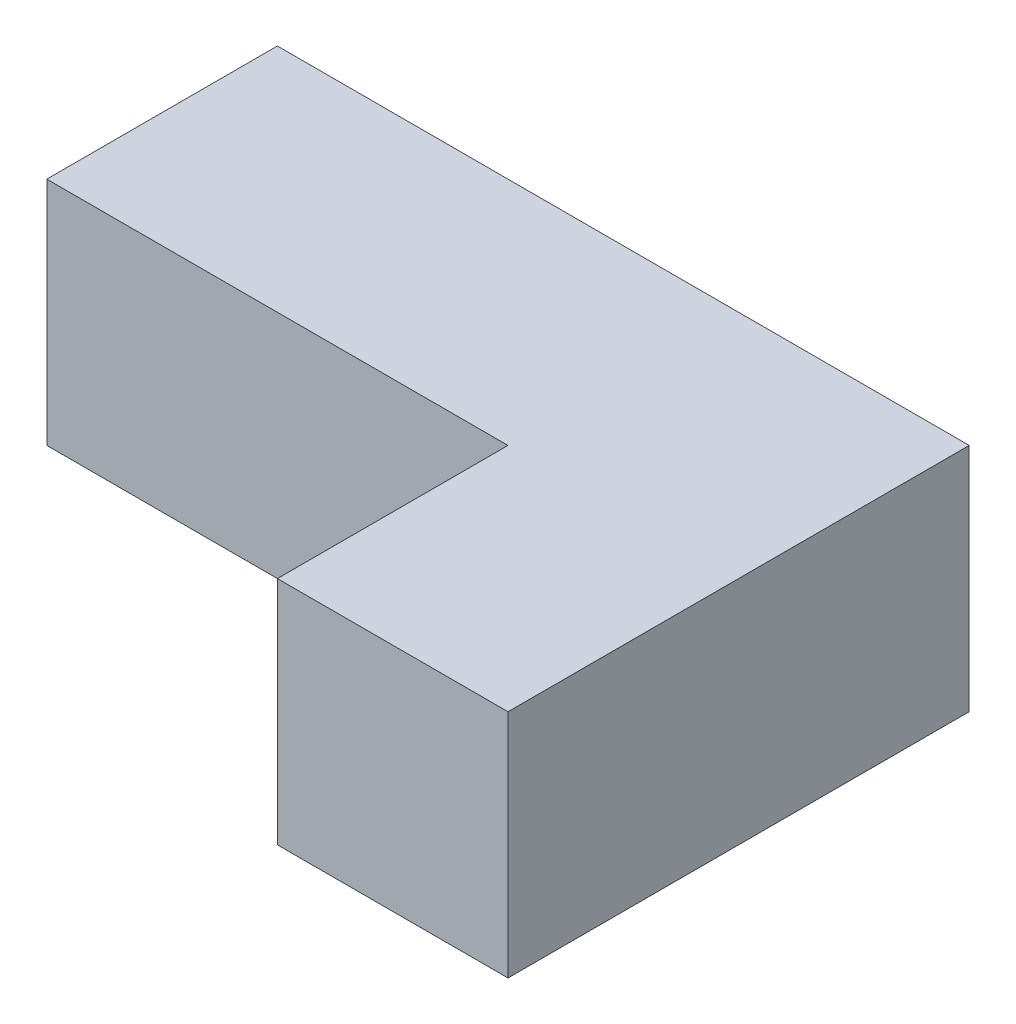
ISO-10303-21;
HEADER;
FILE_DESCRIPTION(('STEP AP214'),'2;1');
FILE_NAME('part.step','',(''),(''),'','','');
FILE_SCHEMA(('AUTOMOTIVE_DESIGN { 1 0 10303 214 1 1 1 1 }'));
ENDSEC;
DATA;
#1=APPLICATION_CONTEXT('core data for automotive mechanical design processes');
#2=APPLICATION_PROTOCOL_DEFINITION('international standard','automotive_design',2000,#1);
#3=PRODUCT_CONTEXT('',#1,'mechanical');
#4=PRODUCT('Part','Part','',(#3));
#5=PRODUCT_RELATED_PRODUCT_CATEGORY('part','',(#4));
#6=PRODUCT_DEFINITION_FORMATION('','',#4);
#7=PRODUCT_DEFINITION_CONTEXT('part definition',#1,'design');
#8=PRODUCT_DEFINITION('design','',#6,#7);
#9=PRODUCT_DEFINITION_SHAPE('','',#8);
#10=(LENGTH_UNIT() NAMED_UNIT(*) SI_UNIT(.MILLI.,.METRE.));
#11=(NAMED_UNIT(*) PLANE_ANGLE_UNIT() SI_UNIT($,.RADIAN.));
#12=(NAMED_UNIT(*) SI_UNIT($,.STERADIAN.) SOLID_ANGLE_UNIT());
#13=UNCERTAINTY_MEASURE_WITH_UNIT(LENGTH_MEASURE(1.E-05),#10,'distance_accuracy_value','');
#14=(GEOMETRIC_REPRESENTATION_CONTEXT(3) GLOBAL_UNCERTAINTY_ASSIGNED_CONTEXT((#13)) GLOBAL_UNIT_ASSIGNED_CONTEXT((#10,
#11,#12)) REPRESENTATION_CONTEXT('',''));
#15=CARTESIAN_POINT('',(0.,0.,0.));
#16=DIRECTION('',(0.,0.,1.));
#17=DIRECTION('',(1.,0.,0.));
#18=AXIS2_PLACEMENT_3D('',#15,#16,#17);
#19=CARTESIAN_POINT('',(38.1,25.4,25.4));
#20=DIRECTION('',(-1.,0.,0.));
#21=DIRECTION('',(0.,0.,1.));
#22=AXIS2_PLACEMENT_3D('',#19,#20,#21);
#23=PLANE('',#22);
#24=DIRECTION('',(0.,0.,-1.));
#25=VECTOR('',#24,1.);
#26=CARTESIAN_POINT('',(38.1,0.,25.4));
#27=LINE('',#26,#25);
#28=CARTESIAN_POINT('',(38.1,0.,25.4));
#29=VERTEX_POINT('',#28);
#30=CARTESIAN_POINT('',(38.1,0.,-25.4));
#31=VERTEX_POINT('',#30);
#32=EDGE_CURVE('E107',#29,#31,#27,.T.);
#33=ORIENTED_EDGE('',*,*,#32,.T.);
#34=DIRECTION('',(0.,-1.,0.));
#35=VECTOR('',#34,1.);
#36=CARTESIAN_POINT('',(38.1,25.4,-25.4));
#37=LINE('',#36,#35);
#38=CARTESIAN_POINT('',(38.1,25.4,-25.4));
#39=VERTEX_POINT('',#38);
#40=EDGE_CURVE('E11',#39,#31,#37,.T.);
#41=ORIENTED_EDGE('',*,*,#40,.F.);
#42=DIRECTION('',(0.,0.,-1.));
#43=VECTOR('',#42,1.);
#44=CARTESIAN_POINT('',(38.1,25.4,25.4));
#45=LINE('',#44,#43);
#46=CARTESIAN_POINT('',(38.1,25.4,25.4));
#47=VERTEX_POINT('',#46);
#48=EDGE_CURVE('E108',#47,#39,#45,.T.);
#49=ORIENTED_EDGE('',*,*,#48,.F.);
#50=DIRECTION('',(0.,-1.,0.));
#51=VECTOR('',#50,1.);
#52=CARTESIAN_POINT('',(38.1,25.4,25.4));
#53=LINE('',#52,#51);
#54=EDGE_CURVE('E117',#47,#29,#53,.T.);
#55=ORIENTED_EDGE('',*,*,#54,.T.);
#56=EDGE_LOOP('',(#33,#41,#49,#55));
#57=FACE_BOUND('',#56,.T.);
#58=ADVANCED_FACE('F33',(#57),#23,.F.);
#59=CARTESIAN_POINT('',(-38.1,25.4,-25.4));
#60=DIRECTION('',(0.,0.,1.));
#61=DIRECTION('',(1.,0.,0.));
#62=AXIS2_PLACEMENT_3D('',#59,#60,#61);
#63=PLANE('',#62);
#64=DIRECTION('',(-1.,0.,0.));
#65=VECTOR('',#64,1.);
#66=CARTESIAN_POINT('',(-38.1,0.,-25.4));
#67=LINE('',#66,#65);
#68=CARTESIAN_POINT('',(-38.1,0.,-25.4));
#69=VERTEX_POINT('',#68);
#70=EDGE_CURVE('E113',#31,#69,#67,.T.);
#71=ORIENTED_EDGE('',*,*,#70,.T.);
#72=DIRECTION('',(0.,-1.,0.));
#73=VECTOR('',#72,1.);
#74=CARTESIAN_POINT('',(-38.1,25.4,-25.4));
#75=LINE('',#74,#73);
#76=CARTESIAN_POINT('',(-38.1,25.4,-25.4));
#77=VERTEX_POINT('',#76);
#78=EDGE_CURVE('E40',#77,#69,#75,.T.);
#79=ORIENTED_EDGE('',*,*,#78,.F.);
#80=DIRECTION('',(-1.,0.,0.));
#81=VECTOR('',#80,1.);
#82=CARTESIAN_POINT('',(-38.1,25.4,-25.4));
#83=LINE('',#82,#81);
#84=EDGE_CURVE('E79',#39,#77,#83,.T.);
#85=ORIENTED_EDGE('',*,*,#84,.F.);
#86=ORIENTED_EDGE('',*,*,#40,.T.);
#87=EDGE_LOOP('',(#71,#79,#85,#86));
#88=FACE_BOUND('',#87,.T.);
#89=ADVANCED_FACE('F137',(#88),#63,.F.);
#90=CARTESIAN_POINT('',(-38.1,25.4,25.4));
#91=DIRECTION('',(1.,0.,0.));
#92=DIRECTION('',(0.,0.,-1.));
#93=AXIS2_PLACEMENT_3D('',#90,#91,#92);
#94=PLANE('',#93);
#95=DIRECTION('',(0.,0.,1.));
#96=VECTOR('',#95,1.);
#97=CARTESIAN_POINT('',(-38.1,0.,25.4));
#98=LINE('',#97,#96);
#99=CARTESIAN_POINT('',(-38.1,0.,0.));
#100=VERTEX_POINT('',#99);
#101=EDGE_CURVE('E109',#69,#100,#98,.T.);
#102=ORIENTED_EDGE('',*,*,#101,.T.);
#103=DIRECTION('',(0.,1.,0.));
#104=VECTOR('',#103,1.);
#105=CARTESIAN_POINT('',(-38.1,0.,0.));
#106=LINE('',#105,#104);
#107=CARTESIAN_POINT('',(-38.1,25.4,0.));
#108=VERTEX_POINT('',#107);
#109=EDGE_CURVE('E131',#100,#108,#106,.T.);
#110=ORIENTED_EDGE('',*,*,#109,.T.);
#111=DIRECTION('',(0.,0.,1.));
#112=VECTOR('',#111,1.);
#113=CARTESIAN_POINT('',(-38.1,25.4,25.4));
#114=LINE('',#113,#112);
#115=EDGE_CURVE('E125',#77,#108,#114,.T.);
#116=ORIENTED_EDGE('',*,*,#115,.F.);
#117=ORIENTED_EDGE('',*,*,#78,.T.);
#118=EDGE_LOOP('',(#102,#110,#116,#117));
#119=FACE_BOUND('',#118,.T.);
#120=ADVANCED_FACE('F122',(#119),#94,.F.);
#121=CARTESIAN_POINT('',(-38.1,25.4,25.4));
#122=DIRECTION('',(0.,0.,-1.));
#123=DIRECTION('',(-1.,0.,0.));
#124=AXIS2_PLACEMENT_3D('',#121,#122,#123);
#125=PLANE('',#124);
#126=DIRECTION('',(1.,0.,0.));
#127=VECTOR('',#126,1.);
#128=CARTESIAN_POINT('',(-38.1,25.4,25.4));
#129=LINE('',#128,#127);
#130=CARTESIAN_POINT('',(12.7,25.4,25.4));
#131=VERTEX_POINT('',#130);
#132=EDGE_CURVE('E56',#131,#47,#129,.T.);
#133=ORIENTED_EDGE('',*,*,#132,.F.);
#134=DIRECTION('',(0.,1.,0.));
#135=VECTOR('',#134,1.);
#136=CARTESIAN_POINT('',(12.7,0.,25.4));
#137=LINE('',#136,#135);
#138=CARTESIAN_POINT('',(12.7,0.,25.4));
#139=VERTEX_POINT('',#138);
#140=EDGE_CURVE('E97',#139,#131,#137,.T.);
#141=ORIENTED_EDGE('',*,*,#140,.F.);
#142=DIRECTION('',(1.,0.,0.));
#143=VECTOR('',#142,1.);
#144=CARTESIAN_POINT('',(-38.1,0.,25.4));
#145=LINE('',#144,#143);
#146=EDGE_CURVE('E74',#139,#29,#145,.T.);
#147=ORIENTED_EDGE('',*,*,#146,.T.);
#148=ORIENTED_EDGE('',*,*,#54,.F.);
#149=EDGE_LOOP('',(#133,#141,#147,#148));
#150=FACE_BOUND('',#149,.T.);
#151=ADVANCED_FACE('F102',(#150),#125,.F.);
#152=CARTESIAN_POINT('',(0.,25.4,0.));
#153=DIRECTION('',(0.,-1.,0.));
#154=DIRECTION('',(0.,0.,-1.));
#155=AXIS2_PLACEMENT_3D('',#152,#153,#154);
#156=PLANE('',#155);
#157=ORIENTED_EDGE('',*,*,#115,.T.);
#158=DIRECTION('',(-1.,0.,0.));
#159=VECTOR('',#158,1.);
#160=CARTESIAN_POINT('',(-38.1,25.4,0.));
#161=LINE('',#160,#159);
#162=CARTESIAN_POINT('',(12.7,25.4,0.));
#163=VERTEX_POINT('',#162);
#164=EDGE_CURVE('E100',#163,#108,#161,.T.);
#165=ORIENTED_EDGE('',*,*,#164,.F.);
#166=DIRECTION('',(0.,0.,-1.));
#167=VECTOR('',#166,1.);
#168=CARTESIAN_POINT('',(12.7,25.4,25.4));
#169=LINE('',#168,#167);
#170=EDGE_CURVE('E128',#131,#163,#169,.T.);
#171=ORIENTED_EDGE('',*,*,#170,.F.);
#172=ORIENTED_EDGE('',*,*,#132,.T.);
#173=ORIENTED_EDGE('',*,*,#48,.T.);
#174=ORIENTED_EDGE('',*,*,#84,.T.);
#175=EDGE_LOOP('',(#157,#165,#171,#172,#173,#174));
#176=FACE_BOUND('',#175,.T.);
#177=ADVANCED_FACE('F141',(#176),#156,.F.);
#178=CARTESIAN_POINT('',(0.,0.,0.));
#179=DIRECTION('',(0.,-1.,0.));
#180=DIRECTION('',(0.,0.,-1.));
#181=AXIS2_PLACEMENT_3D('',#178,#179,#180);
#182=PLANE('',#181);
#183=DIRECTION('',(-1.,0.,0.));
#184=VECTOR('',#183,1.);
#185=CARTESIAN_POINT('',(-38.1,0.,0.));
#186=LINE('',#185,#184);
#187=CARTESIAN_POINT('',(12.7,0.,0.));
#188=VERTEX_POINT('',#187);
#189=EDGE_CURVE('E47',#188,#100,#186,.T.);
#190=ORIENTED_EDGE('',*,*,#189,.T.);
#191=ORIENTED_EDGE('',*,*,#101,.F.);
#192=ORIENTED_EDGE('',*,*,#70,.F.);
#193=ORIENTED_EDGE('',*,*,#32,.F.);
#194=ORIENTED_EDGE('',*,*,#146,.F.);
#195=DIRECTION('',(0.,0.,-1.));
#196=VECTOR('',#195,1.);
#197=CARTESIAN_POINT('',(12.7,0.,25.4));
#198=LINE('',#197,#196);
#199=EDGE_CURVE('E94',#139,#188,#198,.T.);
#200=ORIENTED_EDGE('',*,*,#199,.T.);
#201=EDGE_LOOP('',(#190,#191,#192,#193,#194,#200));
#202=FACE_BOUND('',#201,.T.);
#203=ADVANCED_FACE('F105',(#202),#182,.T.);
#204=CARTESIAN_POINT('',(-38.1,0.,0.));
#205=DIRECTION('',(0.,0.,-1.));
#206=DIRECTION('',(-1.,0.,0.));
#207=AXIS2_PLACEMENT_3D('',#204,#205,#206);
#208=PLANE('',#207);
#209=ORIENTED_EDGE('',*,*,#164,.T.);
#210=ORIENTED_EDGE('',*,*,#109,.F.);
#211=ORIENTED_EDGE('',*,*,#189,.F.);
#212=DIRECTION('',(0.,1.,0.));
#213=VECTOR('',#212,1.);
#214=CARTESIAN_POINT('',(12.7,0.,0.));
#215=LINE('',#214,#213);
#216=EDGE_CURVE('E98',#188,#163,#215,.T.);
#217=ORIENTED_EDGE('',*,*,#216,.T.);
#218=EDGE_LOOP('',(#209,#210,#211,#217));
#219=FACE_BOUND('',#218,.T.);
#220=ADVANCED_FACE('F143',(#219),#208,.F.);
#221=CARTESIAN_POINT('',(12.7,0.,25.4));
#222=DIRECTION('',(1.,0.,0.));
#223=DIRECTION('',(0.,0.,-1.));
#224=AXIS2_PLACEMENT_3D('',#221,#222,#223);
#225=PLANE('',#224);
#226=ORIENTED_EDGE('',*,*,#170,.T.);
#227=ORIENTED_EDGE('',*,*,#216,.F.);
#228=ORIENTED_EDGE('',*,*,#199,.F.);
#229=ORIENTED_EDGE('',*,*,#140,.T.);
#230=EDGE_LOOP('',(#226,#227,#228,#229));
#231=FACE_BOUND('',#230,.T.);
#232=ADVANCED_FACE('F96',(#231),#225,.F.);
#233=CLOSED_SHELL('',(#58,#89,#120,#151,#177,#203,#220,#232));
#234=MANIFOLD_SOLID_BREP('B2',#233);
#235=ADVANCED_BREP_SHAPE_REPRESENTATION('',(#18,#234),#14);
#236=SHAPE_DEFINITION_REPRESENTATION(#9,#235);
ENDSEC;
END-ISO-10303-21;
